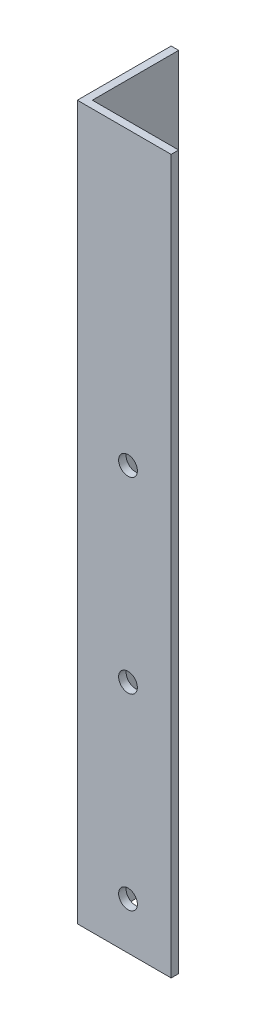
ISO-10303-21;
HEADER;
FILE_DESCRIPTION(('STEP AP214'),'2;1');
FILE_NAME('part.step','',(''),(''),'','','');
FILE_SCHEMA(('AUTOMOTIVE_DESIGN { 1 0 10303 214 1 1 1 1 }'));
ENDSEC;
DATA;
#1=APPLICATION_CONTEXT('core data for automotive mechanical design processes');
#2=APPLICATION_PROTOCOL_DEFINITION('international standard','automotive_design',2000,#1);
#3=PRODUCT_CONTEXT('',#1,'mechanical');
#4=PRODUCT('Part','Part','',(#3));
#5=PRODUCT_RELATED_PRODUCT_CATEGORY('part','',(#4));
#6=PRODUCT_DEFINITION_FORMATION('','',#4);
#7=PRODUCT_DEFINITION_CONTEXT('part definition',#1,'design');
#8=PRODUCT_DEFINITION('design','',#6,#7);
#9=PRODUCT_DEFINITION_SHAPE('','',#8);
#10=(LENGTH_UNIT() NAMED_UNIT(*) SI_UNIT(.MILLI.,.METRE.));
#11=(NAMED_UNIT(*) PLANE_ANGLE_UNIT() SI_UNIT($,.RADIAN.));
#12=(NAMED_UNIT(*) SI_UNIT($,.STERADIAN.) SOLID_ANGLE_UNIT());
#13=UNCERTAINTY_MEASURE_WITH_UNIT(LENGTH_MEASURE(1.E-05),#10,'distance_accuracy_value','');
#14=(GEOMETRIC_REPRESENTATION_CONTEXT(3) GLOBAL_UNCERTAINTY_ASSIGNED_CONTEXT((#13)) GLOBAL_UNIT_ASSIGNED_CONTEXT((#10,
#11,#12)) REPRESENTATION_CONTEXT('',''));
#15=CARTESIAN_POINT('',(0.,0.,0.));
#16=DIRECTION('',(0.,0.,1.));
#17=DIRECTION('',(1.,0.,0.));
#18=AXIS2_PLACEMENT_3D('',#15,#16,#17);
#19=CARTESIAN_POINT('',(4.,380.,0.));
#20=DIRECTION('',(-1.,0.,0.));
#21=DIRECTION('',(0.,0.,1.));
#22=AXIS2_PLACEMENT_3D('',#19,#20,#21);
#23=PLANE('',#22);
#24=CARTESIAN_POINT('',(4.,125.,-23.0000000000039));
#25=DIRECTION('',(-1.,0.,0.));
#26=DIRECTION('',(0.,0.,1.));
#27=AXIS2_PLACEMENT_3D('',#24,#25,#26);
#28=CIRCLE('',#27,4.99999999999999);
#29=CARTESIAN_POINT('',(4.,125.,-18.0000000000039));
#30=VERTEX_POINT('',#29);
#31=EDGE_CURVE('E189',#30,#30,#28,.T.);
#32=ORIENTED_EDGE('',*,*,#31,.T.);
#33=EDGE_LOOP('',(#32));
#34=FACE_BOUND('',#33,.T.);
#35=CARTESIAN_POINT('',(4.,25.,-23.));
#36=DIRECTION('',(-1.,0.,0.));
#37=DIRECTION('',(0.,0.,1.));
#38=AXIS2_PLACEMENT_3D('',#35,#36,#37);
#39=CIRCLE('',#38,5.);
#40=CARTESIAN_POINT('',(4.,25.,-18.));
#41=VERTEX_POINT('',#40);
#42=EDGE_CURVE('E193',#41,#41,#39,.T.);
#43=ORIENTED_EDGE('',*,*,#42,.T.);
#44=EDGE_LOOP('',(#43));
#45=FACE_BOUND('',#44,.T.);
#46=CARTESIAN_POINT('',(4.,225.,-23.0000000000078));
#47=DIRECTION('',(-1.,0.,0.));
#48=DIRECTION('',(0.,0.,1.));
#49=AXIS2_PLACEMENT_3D('',#46,#47,#48);
#50=CIRCLE('',#49,5.);
#51=CARTESIAN_POINT('',(4.,225.,-18.0000000000078));
#52=VERTEX_POINT('',#51);
#53=EDGE_CURVE('E150',#52,#52,#50,.T.);
#54=ORIENTED_EDGE('',*,*,#53,.T.);
#55=EDGE_LOOP('',(#54));
#56=FACE_BOUND('',#55,.T.);
#57=DIRECTION('',(0.,0.,-1.));
#58=VECTOR('',#57,1.);
#59=CARTESIAN_POINT('',(4.,0.,0.));
#60=LINE('',#59,#58);
#61=CARTESIAN_POINT('',(4.,0.,-4.));
#62=VERTEX_POINT('',#61);
#63=CARTESIAN_POINT('',(4.,0.,-50.));
#64=VERTEX_POINT('',#63);
#65=EDGE_CURVE('E118',#62,#64,#60,.T.);
#66=ORIENTED_EDGE('',*,*,#65,.T.);
#67=DIRECTION('',(0.,-1.,0.));
#68=VECTOR('',#67,1.);
#69=CARTESIAN_POINT('',(4.,380.,-50.));
#70=LINE('',#69,#68);
#71=CARTESIAN_POINT('',(4.,380.,-50.));
#72=VERTEX_POINT('',#71);
#73=EDGE_CURVE('E11',#72,#64,#70,.T.);
#74=ORIENTED_EDGE('',*,*,#73,.F.);
#75=DIRECTION('',(0.,0.,-1.));
#76=VECTOR('',#75,1.);
#77=CARTESIAN_POINT('',(4.,380.,0.));
#78=LINE('',#77,#76);
#79=CARTESIAN_POINT('',(4.,380.,-4.));
#80=VERTEX_POINT('',#79);
#81=EDGE_CURVE('E83',#80,#72,#78,.T.);
#82=ORIENTED_EDGE('',*,*,#81,.F.);
#83=DIRECTION('',(0.,-1.,0.));
#84=VECTOR('',#83,1.);
#85=CARTESIAN_POINT('',(4.,380.,-4.));
#86=LINE('',#85,#84);
#87=EDGE_CURVE('E114',#80,#62,#86,.T.);
#88=ORIENTED_EDGE('',*,*,#87,.T.);
#89=EDGE_LOOP('',(#66,#74,#82,#88));
#90=FACE_BOUND('',#89,.T.);
#91=ADVANCED_FACE('F35',(#34,#45,#56,#90),#23,.F.);
#92=CARTESIAN_POINT('',(0.,380.,-50.));
#93=DIRECTION('',(0.,0.,-1.));
#94=DIRECTION('',(-1.,0.,0.));
#95=AXIS2_PLACEMENT_3D('',#92,#93,#94);
#96=PLANE('',#95);
#97=DIRECTION('',(1.,0.,0.));
#98=VECTOR('',#97,1.);
#99=CARTESIAN_POINT('',(0.,0.,-50.));
#100=LINE('',#99,#98);
#101=CARTESIAN_POINT('',(0.,0.,-50.));
#102=VERTEX_POINT('',#101);
#103=EDGE_CURVE('E121',#102,#64,#100,.T.);
#104=ORIENTED_EDGE('',*,*,#103,.F.);
#105=DIRECTION('',(0.,-1.,0.));
#106=VECTOR('',#105,1.);
#107=CARTESIAN_POINT('',(0.,380.,-50.));
#108=LINE('',#107,#106);
#109=CARTESIAN_POINT('',(0.,380.,-50.));
#110=VERTEX_POINT('',#109);
#111=EDGE_CURVE('E44',#110,#102,#108,.T.);
#112=ORIENTED_EDGE('',*,*,#111,.F.);
#113=DIRECTION('',(1.,0.,0.));
#114=VECTOR('',#113,1.);
#115=CARTESIAN_POINT('',(0.,380.,-50.));
#116=LINE('',#115,#114);
#117=EDGE_CURVE('E158',#110,#72,#116,.T.);
#118=ORIENTED_EDGE('',*,*,#117,.T.);
#119=ORIENTED_EDGE('',*,*,#73,.T.);
#120=EDGE_LOOP('',(#104,#112,#118,#119));
#121=FACE_BOUND('',#120,.T.);
#122=ADVANCED_FACE('F180',(#121),#96,.T.);
#123=CARTESIAN_POINT('',(0.,380.,0.));
#124=DIRECTION('',(-1.,0.,0.));
#125=DIRECTION('',(0.,0.,1.));
#126=AXIS2_PLACEMENT_3D('',#123,#124,#125);
#127=PLANE('',#126);
#128=CARTESIAN_POINT('',(0.,125.,-23.0000000000039));
#129=DIRECTION('',(-1.,0.,0.));
#130=DIRECTION('',(0.,0.,1.));
#131=AXIS2_PLACEMENT_3D('',#128,#129,#130);
#132=CIRCLE('',#131,4.99999999999999);
#133=CARTESIAN_POINT('',(0.,125.,-18.0000000000039));
#134=VERTEX_POINT('',#133);
#135=EDGE_CURVE('E204',#134,#134,#132,.T.);
#136=ORIENTED_EDGE('',*,*,#135,.F.);
#137=EDGE_LOOP('',(#136));
#138=FACE_BOUND('',#137,.T.);
#139=CARTESIAN_POINT('',(0.,25.,-23.));
#140=DIRECTION('',(-1.,0.,0.));
#141=DIRECTION('',(0.,0.,1.));
#142=AXIS2_PLACEMENT_3D('',#139,#140,#141);
#143=CIRCLE('',#142,5.);
#144=CARTESIAN_POINT('',(0.,25.,-18.));
#145=VERTEX_POINT('',#144);
#146=EDGE_CURVE('E205',#145,#145,#143,.T.);
#147=ORIENTED_EDGE('',*,*,#146,.F.);
#148=EDGE_LOOP('',(#147));
#149=FACE_BOUND('',#148,.T.);
#150=CARTESIAN_POINT('',(0.,225.,-23.0000000000078));
#151=DIRECTION('',(-1.,0.,0.));
#152=DIRECTION('',(0.,0.,1.));
#153=AXIS2_PLACEMENT_3D('',#150,#151,#152);
#154=CIRCLE('',#153,5.);
#155=CARTESIAN_POINT('',(0.,225.,-18.0000000000078));
#156=VERTEX_POINT('',#155);
#157=EDGE_CURVE('E197',#156,#156,#154,.T.);
#158=ORIENTED_EDGE('',*,*,#157,.F.);
#159=EDGE_LOOP('',(#158));
#160=FACE_BOUND('',#159,.T.);
#161=DIRECTION('',(0.,0.,-1.));
#162=VECTOR('',#161,1.);
#163=CARTESIAN_POINT('',(0.,0.,0.));
#164=LINE('',#163,#162);
#165=CARTESIAN_POINT('',(0.,0.,0.));
#166=VERTEX_POINT('',#165);
#167=EDGE_CURVE('E125',#166,#102,#164,.T.);
#168=ORIENTED_EDGE('',*,*,#167,.F.);
#169=DIRECTION('',(0.,-1.,0.));
#170=VECTOR('',#169,1.);
#171=CARTESIAN_POINT('',(0.,380.,0.));
#172=LINE('',#171,#170);
#173=CARTESIAN_POINT('',(0.,380.,0.));
#174=VERTEX_POINT('',#173);
#175=EDGE_CURVE('E104',#174,#166,#172,.T.);
#176=ORIENTED_EDGE('',*,*,#175,.F.);
#177=DIRECTION('',(0.,0.,-1.));
#178=VECTOR('',#177,1.);
#179=CARTESIAN_POINT('',(0.,380.,0.));
#180=LINE('',#179,#178);
#181=EDGE_CURVE('E110',#174,#110,#180,.T.);
#182=ORIENTED_EDGE('',*,*,#181,.T.);
#183=ORIENTED_EDGE('',*,*,#111,.T.);
#184=EDGE_LOOP('',(#168,#176,#182,#183));
#185=FACE_BOUND('',#184,.T.);
#186=ADVANCED_FACE('F162',(#138,#149,#160,#185),#127,.T.);
#187=CARTESIAN_POINT('',(0.,380.,0.));
#188=DIRECTION('',(0.,0.,1.));
#189=DIRECTION('',(1.,0.,0.));
#190=AXIS2_PLACEMENT_3D('',#187,#188,#189);
#191=PLANE('',#190);
#192=CARTESIAN_POINT('',(26.9999999999961,125.,0.));
#193=DIRECTION('',(0.,0.,1.));
#194=DIRECTION('',(1.,0.,0.));
#195=AXIS2_PLACEMENT_3D('',#192,#193,#194);
#196=CIRCLE('',#195,5.00000000000001);
#197=CARTESIAN_POINT('',(31.9999999999961,125.,0.));
#198=VERTEX_POINT('',#197);
#199=EDGE_CURVE('E140',#198,#198,#196,.T.);
#200=ORIENTED_EDGE('',*,*,#199,.F.);
#201=EDGE_LOOP('',(#200));
#202=FACE_BOUND('',#201,.T.);
#203=CARTESIAN_POINT('',(27.,25.,0.));
#204=DIRECTION('',(0.,0.,1.));
#205=DIRECTION('',(1.,0.,0.));
#206=AXIS2_PLACEMENT_3D('',#203,#204,#205);
#207=CIRCLE('',#206,5.);
#208=CARTESIAN_POINT('',(32.,25.,0.));
#209=VERTEX_POINT('',#208);
#210=EDGE_CURVE('E145',#209,#209,#207,.T.);
#211=ORIENTED_EDGE('',*,*,#210,.F.);
#212=EDGE_LOOP('',(#211));
#213=FACE_BOUND('',#212,.T.);
#214=CARTESIAN_POINT('',(26.9999999999922,225.,0.));
#215=DIRECTION('',(0.,0.,1.));
#216=DIRECTION('',(1.,0.,0.));
#217=AXIS2_PLACEMENT_3D('',#214,#215,#216);
#218=CIRCLE('',#217,5.);
#219=CARTESIAN_POINT('',(31.9999999999922,225.,0.));
#220=VERTEX_POINT('',#219);
#221=EDGE_CURVE('E137',#220,#220,#218,.T.);
#222=ORIENTED_EDGE('',*,*,#221,.F.);
#223=EDGE_LOOP('',(#222));
#224=FACE_BOUND('',#223,.T.);
#225=DIRECTION('',(-1.,0.,0.));
#226=VECTOR('',#225,1.);
#227=CARTESIAN_POINT('',(0.,0.,0.));
#228=LINE('',#227,#226);
#229=CARTESIAN_POINT('',(50.,0.,0.));
#230=VERTEX_POINT('',#229);
#231=EDGE_CURVE('E99',#230,#166,#228,.T.);
#232=ORIENTED_EDGE('',*,*,#231,.F.);
#233=DIRECTION('',(0.,-1.,0.));
#234=VECTOR('',#233,1.);
#235=CARTESIAN_POINT('',(50.,380.,0.));
#236=LINE('',#235,#234);
#237=CARTESIAN_POINT('',(50.,380.,0.));
#238=VERTEX_POINT('',#237);
#239=EDGE_CURVE('E94',#238,#230,#236,.T.);
#240=ORIENTED_EDGE('',*,*,#239,.F.);
#241=DIRECTION('',(-1.,0.,0.));
#242=VECTOR('',#241,1.);
#243=CARTESIAN_POINT('',(0.,380.,0.));
#244=LINE('',#243,#242);
#245=EDGE_CURVE('E97',#238,#174,#244,.T.);
#246=ORIENTED_EDGE('',*,*,#245,.T.);
#247=ORIENTED_EDGE('',*,*,#175,.T.);
#248=EDGE_LOOP('',(#232,#240,#246,#247));
#249=FACE_BOUND('',#248,.T.);
#250=ADVANCED_FACE('F96',(#202,#213,#224,#249),#191,.T.);
#251=CARTESIAN_POINT('',(50.,380.,-4.));
#252=DIRECTION('',(1.,0.,0.));
#253=DIRECTION('',(0.,0.,-1.));
#254=AXIS2_PLACEMENT_3D('',#251,#252,#253);
#255=PLANE('',#254);
#256=DIRECTION('',(0.,0.,1.));
#257=VECTOR('',#256,1.);
#258=CARTESIAN_POINT('',(50.,0.,-4.));
#259=LINE('',#258,#257);
#260=CARTESIAN_POINT('',(50.,0.,-4.));
#261=VERTEX_POINT('',#260);
#262=EDGE_CURVE('E129',#261,#230,#259,.T.);
#263=ORIENTED_EDGE('',*,*,#262,.F.);
#264=DIRECTION('',(0.,-1.,0.));
#265=VECTOR('',#264,1.);
#266=CARTESIAN_POINT('',(50.,380.,-4.));
#267=LINE('',#266,#265);
#268=CARTESIAN_POINT('',(50.,380.,-4.));
#269=VERTEX_POINT('',#268);
#270=EDGE_CURVE('E74',#269,#261,#267,.T.);
#271=ORIENTED_EDGE('',*,*,#270,.F.);
#272=DIRECTION('',(0.,0.,1.));
#273=VECTOR('',#272,1.);
#274=CARTESIAN_POINT('',(50.,380.,-4.));
#275=LINE('',#274,#273);
#276=EDGE_CURVE('E108',#269,#238,#275,.T.);
#277=ORIENTED_EDGE('',*,*,#276,.T.);
#278=ORIENTED_EDGE('',*,*,#239,.T.);
#279=EDGE_LOOP('',(#263,#271,#277,#278));
#280=FACE_BOUND('',#279,.T.);
#281=ADVANCED_FACE('F112',(#280),#255,.T.);
#282=CARTESIAN_POINT('',(0.,380.,-4.));
#283=DIRECTION('',(0.,0.,1.));
#284=DIRECTION('',(1.,0.,0.));
#285=AXIS2_PLACEMENT_3D('',#282,#283,#284);
#286=PLANE('',#285);
#287=CARTESIAN_POINT('',(26.9999999999961,125.,-4.));
#288=DIRECTION('',(0.,0.,1.));
#289=DIRECTION('',(1.,0.,0.));
#290=AXIS2_PLACEMENT_3D('',#287,#288,#289);
#291=CIRCLE('',#290,5.00000000000001);
#292=CARTESIAN_POINT('',(31.9999999999961,125.,-4.));
#293=VERTEX_POINT('',#292);
#294=EDGE_CURVE('E38',#293,#293,#291,.T.);
#295=ORIENTED_EDGE('',*,*,#294,.T.);
#296=EDGE_LOOP('',(#295));
#297=FACE_BOUND('',#296,.T.);
#298=CARTESIAN_POINT('',(27.,25.,-4.));
#299=DIRECTION('',(0.,0.,1.));
#300=DIRECTION('',(1.,0.,0.));
#301=AXIS2_PLACEMENT_3D('',#298,#299,#300);
#302=CIRCLE('',#301,5.);
#303=CARTESIAN_POINT('',(32.,25.,-4.));
#304=VERTEX_POINT('',#303);
#305=EDGE_CURVE('E138',#304,#304,#302,.T.);
#306=ORIENTED_EDGE('',*,*,#305,.T.);
#307=EDGE_LOOP('',(#306));
#308=FACE_BOUND('',#307,.T.);
#309=CARTESIAN_POINT('',(26.9999999999922,225.,-4.));
#310=DIRECTION('',(0.,0.,1.));
#311=DIRECTION('',(1.,0.,0.));
#312=AXIS2_PLACEMENT_3D('',#309,#310,#311);
#313=CIRCLE('',#312,5.);
#314=CARTESIAN_POINT('',(31.9999999999922,225.,-4.));
#315=VERTEX_POINT('',#314);
#316=EDGE_CURVE('E122',#315,#315,#313,.T.);
#317=ORIENTED_EDGE('',*,*,#316,.T.);
#318=EDGE_LOOP('',(#317));
#319=FACE_BOUND('',#318,.T.);
#320=DIRECTION('',(1.,0.,0.));
#321=VECTOR('',#320,1.);
#322=CARTESIAN_POINT('',(0.,0.,-4.));
#323=LINE('',#322,#321);
#324=EDGE_CURVE('E77',#261,#62,#323,.F.);
#325=ORIENTED_EDGE('',*,*,#324,.T.);
#326=ORIENTED_EDGE('',*,*,#87,.F.);
#327=DIRECTION('',(1.,0.,0.));
#328=VECTOR('',#327,1.);
#329=CARTESIAN_POINT('',(0.,380.,-4.));
#330=LINE('',#329,#328);
#331=EDGE_CURVE('E53',#269,#80,#330,.F.);
#332=ORIENTED_EDGE('',*,*,#331,.F.);
#333=ORIENTED_EDGE('',*,*,#270,.T.);
#334=EDGE_LOOP('',(#325,#326,#332,#333));
#335=FACE_BOUND('',#334,.T.);
#336=ADVANCED_FACE('F168',(#297,#308,#319,#335),#286,.F.);
#337=CARTESIAN_POINT('',(0.,380.,0.));
#338=DIRECTION('',(0.,-1.,0.));
#339=DIRECTION('',(-1.,0.,0.));
#340=AXIS2_PLACEMENT_3D('',#337,#338,#339);
#341=PLANE('',#340);
#342=ORIENTED_EDGE('',*,*,#81,.T.);
#343=ORIENTED_EDGE('',*,*,#117,.F.);
#344=ORIENTED_EDGE('',*,*,#181,.F.);
#345=ORIENTED_EDGE('',*,*,#245,.F.);
#346=ORIENTED_EDGE('',*,*,#276,.F.);
#347=ORIENTED_EDGE('',*,*,#331,.T.);
#348=EDGE_LOOP('',(#342,#343,#344,#345,#346,#347));
#349=FACE_BOUND('',#348,.T.);
#350=ADVANCED_FACE('F107',(#349),#341,.F.);
#351=CARTESIAN_POINT('',(0.,0.,0.));
#352=DIRECTION('',(0.,-1.,0.));
#353=DIRECTION('',(-1.,0.,0.));
#354=AXIS2_PLACEMENT_3D('',#351,#352,#353);
#355=PLANE('',#354);
#356=ORIENTED_EDGE('',*,*,#65,.F.);
#357=ORIENTED_EDGE('',*,*,#324,.F.);
#358=ORIENTED_EDGE('',*,*,#262,.T.);
#359=ORIENTED_EDGE('',*,*,#231,.T.);
#360=ORIENTED_EDGE('',*,*,#167,.T.);
#361=ORIENTED_EDGE('',*,*,#103,.T.);
#362=EDGE_LOOP('',(#356,#357,#358,#359,#360,#361));
#363=FACE_BOUND('',#362,.T.);
#364=ADVANCED_FACE('F166',(#363),#355,.T.);
#365=CARTESIAN_POINT('',(26.9999999999922,225.,-10.));
#366=DIRECTION('',(0.,0.,1.));
#367=DIRECTION('',(1.,0.,0.));
#368=AXIS2_PLACEMENT_3D('',#365,#366,#367);
#369=CYLINDRICAL_SURFACE('',#368,5.);
#370=ORIENTED_EDGE('',*,*,#221,.T.);
#371=EDGE_LOOP('',(#370));
#372=FACE_BOUND('',#371,.T.);
#373=ORIENTED_EDGE('',*,*,#316,.F.);
#374=EDGE_LOOP('',(#373));
#375=FACE_BOUND('',#374,.T.);
#376=ADVANCED_FACE('F238',(#372,#375),#369,.F.);
#377=CARTESIAN_POINT('',(27.,25.,-10.));
#378=DIRECTION('',(0.,0.,1.));
#379=DIRECTION('',(1.,0.,0.));
#380=AXIS2_PLACEMENT_3D('',#377,#378,#379);
#381=CYLINDRICAL_SURFACE('',#380,5.);
#382=ORIENTED_EDGE('',*,*,#210,.T.);
#383=EDGE_LOOP('',(#382));
#384=FACE_BOUND('',#383,.T.);
#385=ORIENTED_EDGE('',*,*,#305,.F.);
#386=EDGE_LOOP('',(#385));
#387=FACE_BOUND('',#386,.T.);
#388=ADVANCED_FACE('F235',(#384,#387),#381,.F.);
#389=CARTESIAN_POINT('',(26.9999999999961,125.,-10.));
#390=DIRECTION('',(0.,0.,1.));
#391=DIRECTION('',(1.,0.,0.));
#392=AXIS2_PLACEMENT_3D('',#389,#390,#391);
#393=CYLINDRICAL_SURFACE('',#392,5.00000000000001);
#394=ORIENTED_EDGE('',*,*,#199,.T.);
#395=EDGE_LOOP('',(#394));
#396=FACE_BOUND('',#395,.T.);
#397=ORIENTED_EDGE('',*,*,#294,.F.);
#398=EDGE_LOOP('',(#397));
#399=FACE_BOUND('',#398,.T.);
#400=ADVANCED_FACE('F230',(#396,#399),#393,.F.);
#401=CARTESIAN_POINT('',(10.,225.,-23.0000000000078));
#402=DIRECTION('',(-1.,0.,0.));
#403=DIRECTION('',(0.,0.,1.));
#404=AXIS2_PLACEMENT_3D('',#401,#402,#403);
#405=CYLINDRICAL_SURFACE('',#404,5.);
#406=ORIENTED_EDGE('',*,*,#157,.T.);
#407=EDGE_LOOP('',(#406));
#408=FACE_BOUND('',#407,.T.);
#409=ORIENTED_EDGE('',*,*,#53,.F.);
#410=EDGE_LOOP('',(#409));
#411=FACE_BOUND('',#410,.T.);
#412=ADVANCED_FACE('F223',(#408,#411),#405,.F.);
#413=CARTESIAN_POINT('',(10.,25.,-23.));
#414=DIRECTION('',(-1.,0.,0.));
#415=DIRECTION('',(0.,0.,1.));
#416=AXIS2_PLACEMENT_3D('',#413,#414,#415);
#417=CYLINDRICAL_SURFACE('',#416,5.);
#418=ORIENTED_EDGE('',*,*,#146,.T.);
#419=EDGE_LOOP('',(#418));
#420=FACE_BOUND('',#419,.T.);
#421=ORIENTED_EDGE('',*,*,#42,.F.);
#422=EDGE_LOOP('',(#421));
#423=FACE_BOUND('',#422,.T.);
#424=ADVANCED_FACE('F220',(#420,#423),#417,.F.);
#425=CARTESIAN_POINT('',(10.,125.,-23.0000000000039));
#426=DIRECTION('',(-1.,0.,0.));
#427=DIRECTION('',(0.,0.,1.));
#428=AXIS2_PLACEMENT_3D('',#425,#426,#427);
#429=CYLINDRICAL_SURFACE('',#428,4.99999999999999);
#430=ORIENTED_EDGE('',*,*,#135,.T.);
#431=EDGE_LOOP('',(#430));
#432=FACE_BOUND('',#431,.T.);
#433=ORIENTED_EDGE('',*,*,#31,.F.);
#434=EDGE_LOOP('',(#433));
#435=FACE_BOUND('',#434,.T.);
#436=ADVANCED_FACE('F211',(#432,#435),#429,.F.);
#437=CLOSED_SHELL('',(#91,#122,#186,#250,#281,#336,#350,#364,#376,#388,#400,#412,#424,#436));
#438=MANIFOLD_SOLID_BREP('B2',#437);
#439=ADVANCED_BREP_SHAPE_REPRESENTATION('',(#18,#438),#14);
#440=SHAPE_DEFINITION_REPRESENTATION(#9,#439);
ENDSEC;
END-ISO-10303-21;
